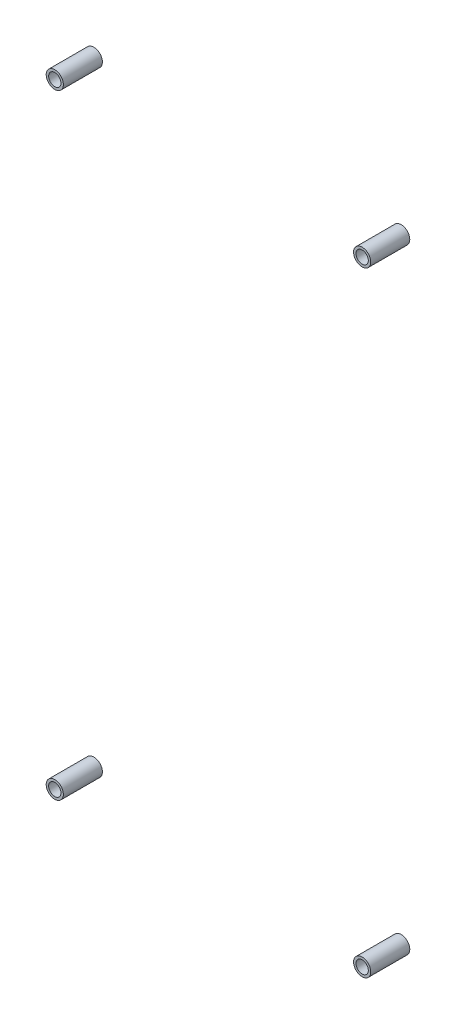
ISO-10303-21;
HEADER;
FILE_DESCRIPTION(('STEP AP214'),'2;1');
FILE_NAME('part.step','',(''),(''),'','','');
FILE_SCHEMA(('AUTOMOTIVE_DESIGN { 1 0 10303 214 1 1 1 1 }'));
ENDSEC;
DATA;
#1=APPLICATION_CONTEXT('core data for automotive mechanical design processes');
#2=APPLICATION_PROTOCOL_DEFINITION('international standard','automotive_design',2000,#1);
#3=PRODUCT_CONTEXT('',#1,'mechanical');
#4=PRODUCT('Part','Part','',(#3));
#5=PRODUCT_RELATED_PRODUCT_CATEGORY('part','',(#4));
#6=PRODUCT_DEFINITION_FORMATION('','',#4);
#7=PRODUCT_DEFINITION_CONTEXT('part definition',#1,'design');
#8=PRODUCT_DEFINITION('design','',#6,#7);
#9=PRODUCT_DEFINITION_SHAPE('','',#8);
#10=(LENGTH_UNIT() NAMED_UNIT(*) SI_UNIT(.MILLI.,.METRE.));
#11=(NAMED_UNIT(*) PLANE_ANGLE_UNIT() SI_UNIT($,.RADIAN.));
#12=(NAMED_UNIT(*) SI_UNIT($,.STERADIAN.) SOLID_ANGLE_UNIT());
#13=UNCERTAINTY_MEASURE_WITH_UNIT(LENGTH_MEASURE(1.E-05),#10,'distance_accuracy_value','');
#14=(GEOMETRIC_REPRESENTATION_CONTEXT(3) GLOBAL_UNCERTAINTY_ASSIGNED_CONTEXT((#13)) GLOBAL_UNIT_ASSIGNED_CONTEXT((#10,
#11,#12)) REPRESENTATION_CONTEXT('',''));
#15=CARTESIAN_POINT('',(0.,0.,0.));
#16=DIRECTION('',(0.,0.,1.));
#17=DIRECTION('',(1.,0.,0.));
#18=AXIS2_PLACEMENT_3D('',#15,#16,#17);
#19=CARTESIAN_POINT('',(-36.2,20.3399999999999,10.16));
#20=DIRECTION('',(0.,0.,1.));
#21=DIRECTION('',(1.,0.,0.));
#22=AXIS2_PLACEMENT_3D('',#19,#20,#21);
#23=PLANE('',#22);
#24=CARTESIAN_POINT('',(-36.2,20.3399999999999,10.16));
#25=DIRECTION('',(0.,0.,1.));
#26=DIRECTION('',(1.,0.,0.));
#27=AXIS2_PLACEMENT_3D('',#24,#25,#26);
#28=CIRCLE('',#27,2.234999975);
#29=CARTESIAN_POINT('',(-33.965000025,20.3399999999999,10.16));
#30=VERTEX_POINT('',#29);
#31=EDGE_CURVE('E12',#30,#30,#28,.T.);
#32=ORIENTED_EDGE('',*,*,#31,.T.);
#33=EDGE_LOOP('',(#32));
#34=FACE_BOUND('',#33,.T.);
#35=CARTESIAN_POINT('',(-36.2,20.3399999999999,10.16));
#36=DIRECTION('',(0.,0.,1.));
#37=DIRECTION('',(1.,0.,0.));
#38=AXIS2_PLACEMENT_3D('',#35,#36,#37);
#39=CIRCLE('',#38,1.59999997500001);
#40=CARTESIAN_POINT('',(-34.600000025,20.3399999999999,10.16));
#41=VERTEX_POINT('',#40);
#42=EDGE_CURVE('E65',#41,#41,#39,.T.);
#43=ORIENTED_EDGE('',*,*,#42,.F.);
#44=EDGE_LOOP('',(#43));
#45=FACE_BOUND('',#44,.T.);
#46=ADVANCED_FACE('F49',(#34,#45),#23,.T.);
#47=CARTESIAN_POINT('',(-36.2,20.3399999999999,0.));
#48=DIRECTION('',(0.,0.,1.));
#49=DIRECTION('',(1.,0.,0.));
#50=AXIS2_PLACEMENT_3D('',#47,#48,#49);
#51=PLANE('',#50);
#52=CARTESIAN_POINT('',(-36.2,20.3399999999999,0.));
#53=DIRECTION('',(0.,0.,1.));
#54=DIRECTION('',(1.,0.,0.));
#55=AXIS2_PLACEMENT_3D('',#52,#53,#54);
#56=CIRCLE('',#55,2.234999975);
#57=CARTESIAN_POINT('',(-33.965000025,20.3399999999999,0.));
#58=VERTEX_POINT('',#57);
#59=EDGE_CURVE('E54',#58,#58,#56,.T.);
#60=ORIENTED_EDGE('',*,*,#59,.F.);
#61=EDGE_LOOP('',(#60));
#62=FACE_BOUND('',#61,.T.);
#63=CARTESIAN_POINT('',(-36.2,20.3399999999999,0.));
#64=DIRECTION('',(0.,0.,1.));
#65=DIRECTION('',(1.,0.,0.));
#66=AXIS2_PLACEMENT_3D('',#63,#64,#65);
#67=CIRCLE('',#66,1.59999997500001);
#68=CARTESIAN_POINT('',(-34.600000025,20.3399999999999,0.));
#69=VERTEX_POINT('',#68);
#70=EDGE_CURVE('E67',#69,#69,#67,.T.);
#71=ORIENTED_EDGE('',*,*,#70,.T.);
#72=EDGE_LOOP('',(#71));
#73=FACE_BOUND('',#72,.T.);
#74=ADVANCED_FACE('F80',(#62,#73),#51,.F.);
#75=CARTESIAN_POINT('',(-36.2,20.3399999999999,10.16));
#76=DIRECTION('',(0.,0.,-1.));
#77=DIRECTION('',(-1.,0.,0.));
#78=AXIS2_PLACEMENT_3D('',#75,#76,#77);
#79=CYLINDRICAL_SURFACE('',#78,2.234999975);
#80=ORIENTED_EDGE('',*,*,#31,.F.);
#81=EDGE_LOOP('',(#80));
#82=FACE_BOUND('',#81,.T.);
#83=ORIENTED_EDGE('',*,*,#59,.T.);
#84=EDGE_LOOP('',(#83));
#85=FACE_BOUND('',#84,.T.);
#86=ADVANCED_FACE('F52',(#82,#85),#79,.T.);
#87=CARTESIAN_POINT('',(-36.2,20.3399999999999,10.16));
#88=DIRECTION('',(0.,0.,-1.));
#89=DIRECTION('',(-1.,0.,0.));
#90=AXIS2_PLACEMENT_3D('',#87,#88,#89);
#91=CYLINDRICAL_SURFACE('',#90,1.59999997500001);
#92=ORIENTED_EDGE('',*,*,#42,.T.);
#93=EDGE_LOOP('',(#92));
#94=FACE_BOUND('',#93,.T.);
#95=ORIENTED_EDGE('',*,*,#70,.F.);
#96=EDGE_LOOP('',(#95));
#97=FACE_BOUND('',#96,.T.);
#98=ADVANCED_FACE('F82',(#94,#97),#91,.F.);
#99=CLOSED_SHELL('',(#46,#74,#86,#98));
#100=MANIFOLD_SOLID_BREP('B2',#99);
#101=CARTESIAN_POINT('',(-116.2,20.3399999999999,10.16));
#102=DIRECTION('',(0.,0.,1.));
#103=DIRECTION('',(1.,0.,0.));
#104=AXIS2_PLACEMENT_3D('',#101,#102,#103);
#105=PLANE('',#104);
#106=CARTESIAN_POINT('',(-116.2,20.3399999999999,10.16));
#107=DIRECTION('',(0.,0.,1.));
#108=DIRECTION('',(1.,0.,0.));
#109=AXIS2_PLACEMENT_3D('',#106,#107,#108);
#110=CIRCLE('',#109,2.234999975);
#111=CARTESIAN_POINT('',(-113.965000025,20.3399999999999,10.16));
#112=VERTEX_POINT('',#111);
#113=EDGE_CURVE('E48',#112,#112,#110,.T.);
#114=ORIENTED_EDGE('',*,*,#113,.T.);
#115=EDGE_LOOP('',(#114));
#116=FACE_BOUND('',#115,.T.);
#117=CARTESIAN_POINT('',(-116.2,20.3399999999999,10.16));
#118=DIRECTION('',(0.,0.,1.));
#119=DIRECTION('',(1.,0.,0.));
#120=AXIS2_PLACEMENT_3D('',#117,#118,#119);
#121=CIRCLE('',#120,1.599999975);
#122=CARTESIAN_POINT('',(-114.600000025,20.3399999999999,10.16));
#123=VERTEX_POINT('',#122);
#124=EDGE_CURVE('E154',#123,#123,#121,.T.);
#125=ORIENTED_EDGE('',*,*,#124,.F.);
#126=EDGE_LOOP('',(#125));
#127=FACE_BOUND('',#126,.T.);
#128=ADVANCED_FACE('F138',(#116,#127),#105,.T.);
#129=CARTESIAN_POINT('',(-116.2,20.3399999999999,0.));
#130=DIRECTION('',(0.,0.,1.));
#131=DIRECTION('',(1.,0.,0.));
#132=AXIS2_PLACEMENT_3D('',#129,#130,#131);
#133=PLANE('',#132);
#134=CARTESIAN_POINT('',(-116.2,20.3399999999999,0.));
#135=DIRECTION('',(0.,0.,1.));
#136=DIRECTION('',(1.,0.,0.));
#137=AXIS2_PLACEMENT_3D('',#134,#135,#136);
#138=CIRCLE('',#137,2.234999975);
#139=CARTESIAN_POINT('',(-113.965000025,20.3399999999999,0.));
#140=VERTEX_POINT('',#139);
#141=EDGE_CURVE('E143',#140,#140,#138,.T.);
#142=ORIENTED_EDGE('',*,*,#141,.F.);
#143=EDGE_LOOP('',(#142));
#144=FACE_BOUND('',#143,.T.);
#145=CARTESIAN_POINT('',(-116.2,20.3399999999999,0.));
#146=DIRECTION('',(0.,0.,1.));
#147=DIRECTION('',(1.,0.,0.));
#148=AXIS2_PLACEMENT_3D('',#145,#146,#147);
#149=CIRCLE('',#148,1.599999975);
#150=CARTESIAN_POINT('',(-114.600000025,20.3399999999999,0.));
#151=VERTEX_POINT('',#150);
#152=EDGE_CURVE('E156',#151,#151,#149,.T.);
#153=ORIENTED_EDGE('',*,*,#152,.T.);
#154=EDGE_LOOP('',(#153));
#155=FACE_BOUND('',#154,.T.);
#156=ADVANCED_FACE('F169',(#144,#155),#133,.F.);
#157=CARTESIAN_POINT('',(-116.2,20.3399999999999,10.16));
#158=DIRECTION('',(0.,0.,-1.));
#159=DIRECTION('',(-1.,0.,0.));
#160=AXIS2_PLACEMENT_3D('',#157,#158,#159);
#161=CYLINDRICAL_SURFACE('',#160,2.234999975);
#162=ORIENTED_EDGE('',*,*,#113,.F.);
#163=EDGE_LOOP('',(#162));
#164=FACE_BOUND('',#163,.T.);
#165=ORIENTED_EDGE('',*,*,#141,.T.);
#166=EDGE_LOOP('',(#165));
#167=FACE_BOUND('',#166,.T.);
#168=ADVANCED_FACE('F141',(#164,#167),#161,.T.);
#169=CARTESIAN_POINT('',(-116.2,20.3399999999999,10.16));
#170=DIRECTION('',(0.,0.,-1.));
#171=DIRECTION('',(-1.,0.,0.));
#172=AXIS2_PLACEMENT_3D('',#169,#170,#171);
#173=CYLINDRICAL_SURFACE('',#172,1.599999975);
#174=ORIENTED_EDGE('',*,*,#124,.T.);
#175=EDGE_LOOP('',(#174));
#176=FACE_BOUND('',#175,.T.);
#177=ORIENTED_EDGE('',*,*,#152,.F.);
#178=EDGE_LOOP('',(#177));
#179=FACE_BOUND('',#178,.T.);
#180=ADVANCED_FACE('F171',(#176,#179),#173,.F.);
#181=CLOSED_SHELL('',(#128,#156,#168,#180));
#182=MANIFOLD_SOLID_BREP('B7',#181);
#183=CARTESIAN_POINT('',(-36.2000000000001,180.34,10.16));
#184=DIRECTION('',(0.,0.,1.));
#185=DIRECTION('',(1.,0.,0.));
#186=AXIS2_PLACEMENT_3D('',#183,#184,#185);
#187=PLANE('',#186);
#188=CARTESIAN_POINT('',(-36.2000000000001,180.34,10.16));
#189=DIRECTION('',(0.,0.,1.));
#190=DIRECTION('',(1.,0.,0.));
#191=AXIS2_PLACEMENT_3D('',#188,#189,#190);
#192=CIRCLE('',#191,2.234999975);
#193=CARTESIAN_POINT('',(-33.9650000250001,180.34,10.16));
#194=VERTEX_POINT('',#193);
#195=EDGE_CURVE('E137',#194,#194,#192,.T.);
#196=ORIENTED_EDGE('',*,*,#195,.T.);
#197=EDGE_LOOP('',(#196));
#198=FACE_BOUND('',#197,.T.);
#199=CARTESIAN_POINT('',(-36.2000000000001,180.34,10.16));
#200=DIRECTION('',(0.,0.,1.));
#201=DIRECTION('',(1.,0.,0.));
#202=AXIS2_PLACEMENT_3D('',#199,#200,#201);
#203=CIRCLE('',#202,1.599999975);
#204=CARTESIAN_POINT('',(-34.600000025,180.34,10.16));
#205=VERTEX_POINT('',#204);
#206=EDGE_CURVE('E242',#205,#205,#203,.T.);
#207=ORIENTED_EDGE('',*,*,#206,.F.);
#208=EDGE_LOOP('',(#207));
#209=FACE_BOUND('',#208,.T.);
#210=ADVANCED_FACE('F226',(#198,#209),#187,.T.);
#211=CARTESIAN_POINT('',(-36.2000000000001,180.34,0.));
#212=DIRECTION('',(0.,0.,1.));
#213=DIRECTION('',(1.,0.,0.));
#214=AXIS2_PLACEMENT_3D('',#211,#212,#213);
#215=PLANE('',#214);
#216=CARTESIAN_POINT('',(-36.2000000000001,180.34,0.));
#217=DIRECTION('',(0.,0.,1.));
#218=DIRECTION('',(1.,0.,0.));
#219=AXIS2_PLACEMENT_3D('',#216,#217,#218);
#220=CIRCLE('',#219,2.234999975);
#221=CARTESIAN_POINT('',(-33.9650000250001,180.34,0.));
#222=VERTEX_POINT('',#221);
#223=EDGE_CURVE('E231',#222,#222,#220,.T.);
#224=ORIENTED_EDGE('',*,*,#223,.F.);
#225=EDGE_LOOP('',(#224));
#226=FACE_BOUND('',#225,.T.);
#227=CARTESIAN_POINT('',(-36.2000000000001,180.34,0.));
#228=DIRECTION('',(0.,0.,1.));
#229=DIRECTION('',(1.,0.,0.));
#230=AXIS2_PLACEMENT_3D('',#227,#228,#229);
#231=CIRCLE('',#230,1.599999975);
#232=CARTESIAN_POINT('',(-34.600000025,180.34,0.));
#233=VERTEX_POINT('',#232);
#234=EDGE_CURVE('E245',#233,#233,#231,.T.);
#235=ORIENTED_EDGE('',*,*,#234,.T.);
#236=EDGE_LOOP('',(#235));
#237=FACE_BOUND('',#236,.T.);
#238=ADVANCED_FACE('F259',(#226,#237),#215,.F.);
#239=CARTESIAN_POINT('',(-36.2000000000001,180.34,10.16));
#240=DIRECTION('',(0.,0.,-1.));
#241=DIRECTION('',(-1.,0.,0.));
#242=AXIS2_PLACEMENT_3D('',#239,#240,#241);
#243=CYLINDRICAL_SURFACE('',#242,2.234999975);
#244=ORIENTED_EDGE('',*,*,#195,.F.);
#245=EDGE_LOOP('',(#244));
#246=FACE_BOUND('',#245,.T.);
#247=ORIENTED_EDGE('',*,*,#223,.T.);
#248=EDGE_LOOP('',(#247));
#249=FACE_BOUND('',#248,.T.);
#250=ADVANCED_FACE('F229',(#246,#249),#243,.T.);
#251=CARTESIAN_POINT('',(-36.2000000000001,180.34,10.16));
#252=DIRECTION('',(0.,0.,-1.));
#253=DIRECTION('',(-1.,0.,0.));
#254=AXIS2_PLACEMENT_3D('',#251,#252,#253);
#255=CYLINDRICAL_SURFACE('',#254,1.599999975);
#256=ORIENTED_EDGE('',*,*,#206,.T.);
#257=EDGE_LOOP('',(#256));
#258=FACE_BOUND('',#257,.T.);
#259=ORIENTED_EDGE('',*,*,#234,.F.);
#260=EDGE_LOOP('',(#259));
#261=FACE_BOUND('',#260,.T.);
#262=ADVANCED_FACE('F255',(#258,#261),#255,.F.);
#263=CLOSED_SHELL('',(#210,#238,#250,#262));
#264=MANIFOLD_SOLID_BREP('B43',#263);
#265=CARTESIAN_POINT('',(-116.2,180.34,10.16));
#266=DIRECTION('',(0.,0.,1.));
#267=DIRECTION('',(1.,0.,0.));
#268=AXIS2_PLACEMENT_3D('',#265,#266,#267);
#269=PLANE('',#268);
#270=CARTESIAN_POINT('',(-116.2,180.34,10.16));
#271=DIRECTION('',(0.,0.,1.));
#272=DIRECTION('',(1.,0.,0.));
#273=AXIS2_PLACEMENT_3D('',#270,#271,#272);
#274=CIRCLE('',#273,2.234999975);
#275=CARTESIAN_POINT('',(-113.965000025,180.34,10.16));
#276=VERTEX_POINT('',#275);
#277=EDGE_CURVE('E225',#276,#276,#274,.T.);
#278=ORIENTED_EDGE('',*,*,#277,.T.);
#279=EDGE_LOOP('',(#278));
#280=FACE_BOUND('',#279,.T.);
#281=CARTESIAN_POINT('',(-116.2,180.34,10.16));
#282=DIRECTION('',(0.,0.,1.));
#283=DIRECTION('',(1.,0.,0.));
#284=AXIS2_PLACEMENT_3D('',#281,#282,#283);
#285=CIRCLE('',#284,1.599999975);
#286=CARTESIAN_POINT('',(-114.600000025,180.34,10.16));
#287=VERTEX_POINT('',#286);
#288=EDGE_CURVE('E322',#287,#287,#285,.T.);
#289=ORIENTED_EDGE('',*,*,#288,.F.);
#290=EDGE_LOOP('',(#289));
#291=FACE_BOUND('',#290,.T.);
#292=ADVANCED_FACE('F306',(#280,#291),#269,.T.);
#293=CARTESIAN_POINT('',(-116.2,180.34,0.));
#294=DIRECTION('',(0.,0.,1.));
#295=DIRECTION('',(1.,0.,0.));
#296=AXIS2_PLACEMENT_3D('',#293,#294,#295);
#297=PLANE('',#296);
#298=CARTESIAN_POINT('',(-116.2,180.34,0.));
#299=DIRECTION('',(0.,0.,1.));
#300=DIRECTION('',(1.,0.,0.));
#301=AXIS2_PLACEMENT_3D('',#298,#299,#300);
#302=CIRCLE('',#301,2.234999975);
#303=CARTESIAN_POINT('',(-113.965000025,180.34,0.));
#304=VERTEX_POINT('',#303);
#305=EDGE_CURVE('E311',#304,#304,#302,.T.);
#306=ORIENTED_EDGE('',*,*,#305,.F.);
#307=EDGE_LOOP('',(#306));
#308=FACE_BOUND('',#307,.T.);
#309=CARTESIAN_POINT('',(-116.2,180.34,0.));
#310=DIRECTION('',(0.,0.,1.));
#311=DIRECTION('',(1.,0.,0.));
#312=AXIS2_PLACEMENT_3D('',#309,#310,#311);
#313=CIRCLE('',#312,1.599999975);
#314=CARTESIAN_POINT('',(-114.600000025,180.34,0.));
#315=VERTEX_POINT('',#314);
#316=EDGE_CURVE('E324',#315,#315,#313,.T.);
#317=ORIENTED_EDGE('',*,*,#316,.T.);
#318=EDGE_LOOP('',(#317));
#319=FACE_BOUND('',#318,.T.);
#320=ADVANCED_FACE('F337',(#308,#319),#297,.F.);
#321=CARTESIAN_POINT('',(-116.2,180.34,10.16));
#322=DIRECTION('',(0.,0.,-1.));
#323=DIRECTION('',(-1.,0.,0.));
#324=AXIS2_PLACEMENT_3D('',#321,#322,#323);
#325=CYLINDRICAL_SURFACE('',#324,2.234999975);
#326=ORIENTED_EDGE('',*,*,#277,.F.);
#327=EDGE_LOOP('',(#326));
#328=FACE_BOUND('',#327,.T.);
#329=ORIENTED_EDGE('',*,*,#305,.T.);
#330=EDGE_LOOP('',(#329));
#331=FACE_BOUND('',#330,.T.);
#332=ADVANCED_FACE('F309',(#328,#331),#325,.T.);
#333=CARTESIAN_POINT('',(-116.2,180.34,10.16));
#334=DIRECTION('',(0.,0.,-1.));
#335=DIRECTION('',(-1.,0.,0.));
#336=AXIS2_PLACEMENT_3D('',#333,#334,#335);
#337=CYLINDRICAL_SURFACE('',#336,1.599999975);
#338=ORIENTED_EDGE('',*,*,#288,.T.);
#339=EDGE_LOOP('',(#338));
#340=FACE_BOUND('',#339,.T.);
#341=ORIENTED_EDGE('',*,*,#316,.F.);
#342=EDGE_LOOP('',(#341));
#343=FACE_BOUND('',#342,.T.);
#344=ADVANCED_FACE('F339',(#340,#343),#337,.F.);
#345=CLOSED_SHELL('',(#292,#320,#332,#344));
#346=MANIFOLD_SOLID_BREP('B132',#345);
#347=ADVANCED_BREP_SHAPE_REPRESENTATION('',(#18,#100,#182,#264,#346),#14);
#348=SHAPE_DEFINITION_REPRESENTATION(#9,#347);
ENDSEC;
END-ISO-10303-21;
